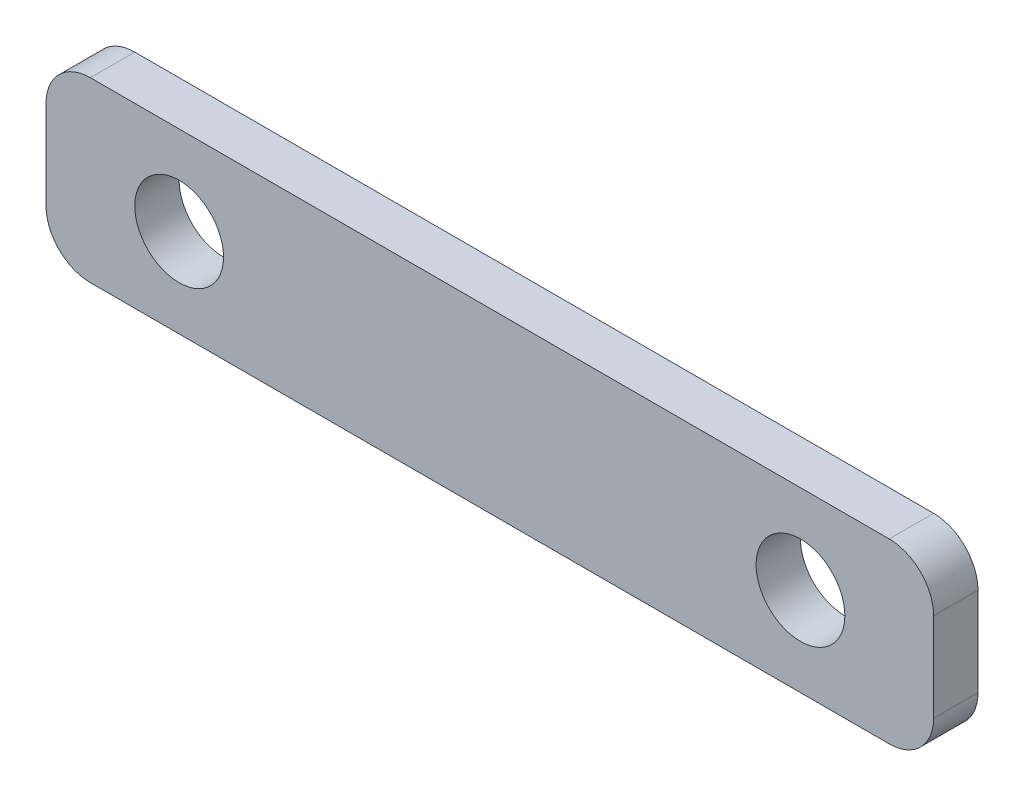
ISO-10303-21;
HEADER;
FILE_DESCRIPTION(('STEP AP214'),'2;1');
FILE_NAME('part.step','',(''),(''),'','','');
FILE_SCHEMA(('AUTOMOTIVE_DESIGN { 1 0 10303 214 1 1 1 1 }'));
ENDSEC;
DATA;
#1=APPLICATION_CONTEXT('core data for automotive mechanical design processes');
#2=APPLICATION_PROTOCOL_DEFINITION('international standard','automotive_design',2000,#1);
#3=PRODUCT_CONTEXT('',#1,'mechanical');
#4=PRODUCT('Part','Part','',(#3));
#5=PRODUCT_RELATED_PRODUCT_CATEGORY('part','',(#4));
#6=PRODUCT_DEFINITION_FORMATION('','',#4);
#7=PRODUCT_DEFINITION_CONTEXT('part definition',#1,'design');
#8=PRODUCT_DEFINITION('design','',#6,#7);
#9=PRODUCT_DEFINITION_SHAPE('','',#8);
#10=(LENGTH_UNIT() NAMED_UNIT(*) SI_UNIT(.MILLI.,.METRE.));
#11=(NAMED_UNIT(*) PLANE_ANGLE_UNIT() SI_UNIT($,.RADIAN.));
#12=(NAMED_UNIT(*) SI_UNIT($,.STERADIAN.) SOLID_ANGLE_UNIT());
#13=UNCERTAINTY_MEASURE_WITH_UNIT(LENGTH_MEASURE(1.E-05),#10,'distance_accuracy_value','');
#14=(GEOMETRIC_REPRESENTATION_CONTEXT(3) GLOBAL_UNCERTAINTY_ASSIGNED_CONTEXT((#13)) GLOBAL_UNIT_ASSIGNED_CONTEXT((#10,
#11,#12)) REPRESENTATION_CONTEXT('',''));
#15=CARTESIAN_POINT('',(0.,0.,0.));
#16=DIRECTION('',(0.,0.,1.));
#17=DIRECTION('',(1.,0.,0.));
#18=AXIS2_PLACEMENT_3D('',#15,#16,#17);
#19=CARTESIAN_POINT('',(-10.,120.683938375693,5.));
#20=DIRECTION('',(0.,0.,1.));
#21=DIRECTION('',(1.,0.,0.));
#22=AXIS2_PLACEMENT_3D('',#19,#20,#21);
#23=PLANE('',#22);
#24=CARTESIAN_POINT('',(-170.,130.683938375693,5.));
#25=DIRECTION('',(0.,0.,1.));
#26=DIRECTION('',(1.,0.,0.));
#27=AXIS2_PLACEMENT_3D('',#24,#25,#26);
#28=CIRCLE('',#27,10.);
#29=CARTESIAN_POINT('',(-160.,130.683938375693,5.));
#30=VERTEX_POINT('',#29);
#31=EDGE_CURVE('E133',#30,#30,#28,.T.);
#32=ORIENTED_EDGE('',*,*,#31,.F.);
#33=EDGE_LOOP('',(#32));
#34=FACE_BOUND('',#33,.T.);
#35=CARTESIAN_POINT('',(-10.,120.683938375693,5.));
#36=DIRECTION('',(0.,0.,1.));
#37=DIRECTION('',(1.,0.,0.));
#38=AXIS2_PLACEMENT_3D('',#35,#36,#37);
#39=CIRCLE('',#38,10.);
#40=CARTESIAN_POINT('',(-10.,110.683938375693,5.));
#41=VERTEX_POINT('',#40);
#42=CARTESIAN_POINT('',(0.,120.683938375693,5.));
#43=VERTEX_POINT('',#42);
#44=EDGE_CURVE('E144',#41,#43,#39,.T.);
#45=ORIENTED_EDGE('',*,*,#44,.T.);
#46=DIRECTION('',(0.,1.,0.));
#47=VECTOR('',#46,1.);
#48=CARTESIAN_POINT('',(0.,140.683938375693,5.));
#49=LINE('',#48,#47);
#50=CARTESIAN_POINT('',(0.,140.683938375693,5.));
#51=VERTEX_POINT('',#50);
#52=EDGE_CURVE('E92',#43,#51,#49,.T.);
#53=ORIENTED_EDGE('',*,*,#52,.T.);
#54=CARTESIAN_POINT('',(-10.,140.683938375693,5.));
#55=DIRECTION('',(0.,0.,1.));
#56=DIRECTION('',(-1.,0.,0.));
#57=AXIS2_PLACEMENT_3D('',#54,#55,#56);
#58=CIRCLE('',#57,9.99999999999999);
#59=CARTESIAN_POINT('',(-10.,150.683938375693,5.));
#60=VERTEX_POINT('',#59);
#61=EDGE_CURVE('E159',#51,#60,#58,.T.);
#62=ORIENTED_EDGE('',*,*,#61,.T.);
#63=DIRECTION('',(-1.,0.,0.));
#64=VECTOR('',#63,1.);
#65=CARTESIAN_POINT('',(-190.,150.683938375693,5.));
#66=LINE('',#65,#64);
#67=CARTESIAN_POINT('',(-190.,150.683938375693,5.));
#68=VERTEX_POINT('',#67);
#69=EDGE_CURVE('E172',#60,#68,#66,.T.);
#70=ORIENTED_EDGE('',*,*,#69,.T.);
#71=CARTESIAN_POINT('',(-190.,140.683938375693,5.));
#72=DIRECTION('',(0.,0.,1.));
#73=DIRECTION('',(1.,0.,0.));
#74=AXIS2_PLACEMENT_3D('',#71,#72,#73);
#75=CIRCLE('',#74,10.);
#76=CARTESIAN_POINT('',(-200.,140.683938375693,5.));
#77=VERTEX_POINT('',#76);
#78=EDGE_CURVE('E111',#68,#77,#75,.T.);
#79=ORIENTED_EDGE('',*,*,#78,.T.);
#80=DIRECTION('',(0.,-1.,0.));
#81=VECTOR('',#80,1.);
#82=CARTESIAN_POINT('',(-200.,140.683938375693,5.));
#83=LINE('',#82,#81);
#84=CARTESIAN_POINT('',(-200.,120.683938375693,5.));
#85=VERTEX_POINT('',#84);
#86=EDGE_CURVE('E105',#77,#85,#83,.T.);
#87=ORIENTED_EDGE('',*,*,#86,.T.);
#88=CARTESIAN_POINT('',(-190.,120.683938375693,5.));
#89=DIRECTION('',(0.,0.,1.));
#90=DIRECTION('',(1.,0.,0.));
#91=AXIS2_PLACEMENT_3D('',#88,#89,#90);
#92=CIRCLE('',#91,10.);
#93=CARTESIAN_POINT('',(-190.,110.683938375693,5.));
#94=VERTEX_POINT('',#93);
#95=EDGE_CURVE('E109',#85,#94,#92,.T.);
#96=ORIENTED_EDGE('',*,*,#95,.T.);
#97=DIRECTION('',(1.,0.,0.));
#98=VECTOR('',#97,1.);
#99=CARTESIAN_POINT('',(-190.,110.683938375693,5.));
#100=LINE('',#99,#98);
#101=EDGE_CURVE('E49',#94,#41,#100,.T.);
#102=ORIENTED_EDGE('',*,*,#101,.T.);
#103=EDGE_LOOP('',(#45,#53,#62,#70,#79,#87,#96,#102));
#104=FACE_BOUND('',#103,.T.);
#105=CARTESIAN_POINT('',(-30.,130.683938375693,5.));
#106=DIRECTION('',(0.,0.,1.));
#107=DIRECTION('',(1.,0.,0.));
#108=AXIS2_PLACEMENT_3D('',#105,#106,#107);
#109=CIRCLE('',#108,10.);
#110=CARTESIAN_POINT('',(-20.,130.683938375693,5.));
#111=VERTEX_POINT('',#110);
#112=EDGE_CURVE('E181',#111,#111,#109,.T.);
#113=ORIENTED_EDGE('',*,*,#112,.F.);
#114=EDGE_LOOP('',(#113));
#115=FACE_BOUND('',#114,.T.);
#116=ADVANCED_FACE('F32',(#34,#104,#115),#23,.T.);
#117=CARTESIAN_POINT('',(-10.,120.683938375693,-5.));
#118=DIRECTION('',(0.,0.,1.));
#119=DIRECTION('',(1.,0.,0.));
#120=AXIS2_PLACEMENT_3D('',#117,#118,#119);
#121=PLANE('',#120);
#122=CARTESIAN_POINT('',(-10.,120.683938375693,-5.));
#123=DIRECTION('',(0.,0.,1.));
#124=DIRECTION('',(1.,0.,0.));
#125=AXIS2_PLACEMENT_3D('',#122,#123,#124);
#126=CIRCLE('',#125,10.);
#127=CARTESIAN_POINT('',(-10.,110.683938375693,-5.));
#128=VERTEX_POINT('',#127);
#129=CARTESIAN_POINT('',(0.,120.683938375693,-5.));
#130=VERTEX_POINT('',#129);
#131=EDGE_CURVE('E129',#128,#130,#126,.T.);
#132=ORIENTED_EDGE('',*,*,#131,.F.);
#133=DIRECTION('',(1.,0.,0.));
#134=VECTOR('',#133,1.);
#135=CARTESIAN_POINT('',(-190.,110.683938375693,-5.));
#136=LINE('',#135,#134);
#137=CARTESIAN_POINT('',(-190.,110.683938375693,-5.));
#138=VERTEX_POINT('',#137);
#139=EDGE_CURVE('E84',#138,#128,#136,.T.);
#140=ORIENTED_EDGE('',*,*,#139,.F.);
#141=CARTESIAN_POINT('',(-190.,120.683938375693,-5.));
#142=DIRECTION('',(0.,0.,1.));
#143=DIRECTION('',(1.,0.,0.));
#144=AXIS2_PLACEMENT_3D('',#141,#142,#143);
#145=CIRCLE('',#144,10.);
#146=CARTESIAN_POINT('',(-200.,120.683938375693,-5.));
#147=VERTEX_POINT('',#146);
#148=EDGE_CURVE('E78',#147,#138,#145,.T.);
#149=ORIENTED_EDGE('',*,*,#148,.F.);
#150=DIRECTION('',(0.,-1.,0.));
#151=VECTOR('',#150,1.);
#152=CARTESIAN_POINT('',(-200.,140.683938375693,-5.));
#153=LINE('',#152,#151);
#154=CARTESIAN_POINT('',(-200.,140.683938375693,-5.));
#155=VERTEX_POINT('',#154);
#156=EDGE_CURVE('E119',#155,#147,#153,.T.);
#157=ORIENTED_EDGE('',*,*,#156,.F.);
#158=CARTESIAN_POINT('',(-190.,140.683938375693,-5.));
#159=DIRECTION('',(0.,0.,1.));
#160=DIRECTION('',(1.,0.,0.));
#161=AXIS2_PLACEMENT_3D('',#158,#159,#160);
#162=CIRCLE('',#161,10.);
#163=CARTESIAN_POINT('',(-190.,150.683938375693,-5.));
#164=VERTEX_POINT('',#163);
#165=EDGE_CURVE('E139',#164,#155,#162,.T.);
#166=ORIENTED_EDGE('',*,*,#165,.F.);
#167=DIRECTION('',(-1.,0.,0.));
#168=VECTOR('',#167,1.);
#169=CARTESIAN_POINT('',(-190.,150.683938375693,-5.));
#170=LINE('',#169,#168);
#171=CARTESIAN_POINT('',(-10.,150.683938375693,-5.));
#172=VERTEX_POINT('',#171);
#173=EDGE_CURVE('E137',#172,#164,#170,.T.);
#174=ORIENTED_EDGE('',*,*,#173,.F.);
#175=CARTESIAN_POINT('',(-10.,140.683938375693,-5.));
#176=DIRECTION('',(0.,0.,1.));
#177=DIRECTION('',(-1.,0.,0.));
#178=AXIS2_PLACEMENT_3D('',#175,#176,#177);
#179=CIRCLE('',#178,9.99999999999999);
#180=CARTESIAN_POINT('',(0.,140.683938375693,-5.));
#181=VERTEX_POINT('',#180);
#182=EDGE_CURVE('E135',#181,#172,#179,.T.);
#183=ORIENTED_EDGE('',*,*,#182,.F.);
#184=DIRECTION('',(0.,1.,0.));
#185=VECTOR('',#184,1.);
#186=CARTESIAN_POINT('',(0.,140.683938375693,-5.));
#187=LINE('',#186,#185);
#188=EDGE_CURVE('E132',#130,#181,#187,.T.);
#189=ORIENTED_EDGE('',*,*,#188,.F.);
#190=EDGE_LOOP('',(#132,#140,#149,#157,#166,#174,#183,#189));
#191=FACE_BOUND('',#190,.T.);
#192=CARTESIAN_POINT('',(-170.,130.683938375693,-5.));
#193=DIRECTION('',(0.,0.,1.));
#194=DIRECTION('',(1.,0.,0.));
#195=AXIS2_PLACEMENT_3D('',#192,#193,#194);
#196=CIRCLE('',#195,10.);
#197=CARTESIAN_POINT('',(-160.,130.683938375693,-5.));
#198=VERTEX_POINT('',#197);
#199=EDGE_CURVE('E178',#198,#198,#196,.T.);
#200=ORIENTED_EDGE('',*,*,#199,.T.);
#201=EDGE_LOOP('',(#200));
#202=FACE_BOUND('',#201,.T.);
#203=CARTESIAN_POINT('',(-30.,130.683938375693,-5.));
#204=DIRECTION('',(0.,0.,1.));
#205=DIRECTION('',(1.,0.,0.));
#206=AXIS2_PLACEMENT_3D('',#203,#204,#205);
#207=CIRCLE('',#206,10.);
#208=CARTESIAN_POINT('',(-20.,130.683938375693,-5.));
#209=VERTEX_POINT('',#208);
#210=EDGE_CURVE('E184',#209,#209,#207,.T.);
#211=ORIENTED_EDGE('',*,*,#210,.T.);
#212=EDGE_LOOP('',(#211));
#213=FACE_BOUND('',#212,.T.);
#214=ADVANCED_FACE('F163',(#191,#202,#213),#121,.F.);
#215=CARTESIAN_POINT('',(-10.,120.683938375693,5.));
#216=DIRECTION('',(0.,0.,-1.));
#217=DIRECTION('',(-1.,0.,0.));
#218=AXIS2_PLACEMENT_3D('',#215,#216,#217);
#219=CYLINDRICAL_SURFACE('',#218,10.);
#220=ORIENTED_EDGE('',*,*,#131,.T.);
#221=DIRECTION('',(0.,0.,-1.));
#222=VECTOR('',#221,1.);
#223=CARTESIAN_POINT('',(0.,120.683938375693,5.));
#224=LINE('',#223,#222);
#225=EDGE_CURVE('E11',#43,#130,#224,.T.);
#226=ORIENTED_EDGE('',*,*,#225,.F.);
#227=ORIENTED_EDGE('',*,*,#44,.F.);
#228=DIRECTION('',(0.,0.,-1.));
#229=VECTOR('',#228,1.);
#230=CARTESIAN_POINT('',(-10.,110.683938375693,5.));
#231=LINE('',#230,#229);
#232=EDGE_CURVE('E125',#41,#128,#231,.T.);
#233=ORIENTED_EDGE('',*,*,#232,.T.);
#234=EDGE_LOOP('',(#220,#226,#227,#233));
#235=FACE_BOUND('',#234,.T.);
#236=ADVANCED_FACE('F34',(#235),#219,.T.);
#237=CARTESIAN_POINT('',(0.,140.683938375693,5.));
#238=DIRECTION('',(-1.,0.,0.));
#239=DIRECTION('',(0.,0.,1.));
#240=AXIS2_PLACEMENT_3D('',#237,#238,#239);
#241=PLANE('',#240);
#242=ORIENTED_EDGE('',*,*,#188,.T.);
#243=DIRECTION('',(0.,0.,-1.));
#244=VECTOR('',#243,1.);
#245=CARTESIAN_POINT('',(0.,140.683938375693,5.));
#246=LINE('',#245,#244);
#247=EDGE_CURVE('E41',#51,#181,#246,.T.);
#248=ORIENTED_EDGE('',*,*,#247,.F.);
#249=ORIENTED_EDGE('',*,*,#52,.F.);
#250=ORIENTED_EDGE('',*,*,#225,.T.);
#251=EDGE_LOOP('',(#242,#248,#249,#250));
#252=FACE_BOUND('',#251,.T.);
#253=ADVANCED_FACE('F216',(#252),#241,.F.);
#254=CARTESIAN_POINT('',(-10.,140.683938375693,5.));
#255=DIRECTION('',(0.,0.,-1.));
#256=DIRECTION('',(-1.,0.,0.));
#257=AXIS2_PLACEMENT_3D('',#254,#255,#256);
#258=CYLINDRICAL_SURFACE('',#257,9.99999999999999);
#259=ORIENTED_EDGE('',*,*,#182,.T.);
#260=DIRECTION('',(0.,0.,-1.));
#261=VECTOR('',#260,1.);
#262=CARTESIAN_POINT('',(-10.,150.683938375693,5.));
#263=LINE('',#262,#261);
#264=EDGE_CURVE('E151',#60,#172,#263,.T.);
#265=ORIENTED_EDGE('',*,*,#264,.F.);
#266=ORIENTED_EDGE('',*,*,#61,.F.);
#267=ORIENTED_EDGE('',*,*,#247,.T.);
#268=EDGE_LOOP('',(#259,#265,#266,#267));
#269=FACE_BOUND('',#268,.T.);
#270=ADVANCED_FACE('F157',(#269),#258,.T.);
#271=CARTESIAN_POINT('',(-190.,150.683938375693,5.));
#272=DIRECTION('',(0.,-1.,0.));
#273=DIRECTION('',(1.,0.,0.));
#274=AXIS2_PLACEMENT_3D('',#271,#272,#273);
#275=PLANE('',#274);
#276=ORIENTED_EDGE('',*,*,#173,.T.);
#277=DIRECTION('',(0.,0.,-1.));
#278=VECTOR('',#277,1.);
#279=CARTESIAN_POINT('',(-190.,150.683938375693,5.));
#280=LINE('',#279,#278);
#281=EDGE_CURVE('E148',#68,#164,#280,.T.);
#282=ORIENTED_EDGE('',*,*,#281,.F.);
#283=ORIENTED_EDGE('',*,*,#69,.F.);
#284=ORIENTED_EDGE('',*,*,#264,.T.);
#285=EDGE_LOOP('',(#276,#282,#283,#284));
#286=FACE_BOUND('',#285,.T.);
#287=ADVANCED_FACE('F168',(#286),#275,.F.);
#288=CARTESIAN_POINT('',(-190.,140.683938375693,5.));
#289=DIRECTION('',(0.,0.,-1.));
#290=DIRECTION('',(-1.,0.,0.));
#291=AXIS2_PLACEMENT_3D('',#288,#289,#290);
#292=CYLINDRICAL_SURFACE('',#291,10.);
#293=ORIENTED_EDGE('',*,*,#165,.T.);
#294=DIRECTION('',(0.,0.,-1.));
#295=VECTOR('',#294,1.);
#296=CARTESIAN_POINT('',(-200.,140.683938375693,5.));
#297=LINE('',#296,#295);
#298=EDGE_CURVE('E120',#77,#155,#297,.T.);
#299=ORIENTED_EDGE('',*,*,#298,.F.);
#300=ORIENTED_EDGE('',*,*,#78,.F.);
#301=ORIENTED_EDGE('',*,*,#281,.T.);
#302=EDGE_LOOP('',(#293,#299,#300,#301));
#303=FACE_BOUND('',#302,.T.);
#304=ADVANCED_FACE('F171',(#303),#292,.T.);
#305=CARTESIAN_POINT('',(-200.,140.683938375693,5.));
#306=DIRECTION('',(1.,0.,0.));
#307=DIRECTION('',(0.,0.,-1.));
#308=AXIS2_PLACEMENT_3D('',#305,#306,#307);
#309=PLANE('',#308);
#310=ORIENTED_EDGE('',*,*,#156,.T.);
#311=DIRECTION('',(0.,0.,-1.));
#312=VECTOR('',#311,1.);
#313=CARTESIAN_POINT('',(-200.,120.683938375693,5.));
#314=LINE('',#313,#312);
#315=EDGE_CURVE('E116',#85,#147,#314,.T.);
#316=ORIENTED_EDGE('',*,*,#315,.F.);
#317=ORIENTED_EDGE('',*,*,#86,.F.);
#318=ORIENTED_EDGE('',*,*,#298,.T.);
#319=EDGE_LOOP('',(#310,#316,#317,#318));
#320=FACE_BOUND('',#319,.T.);
#321=ADVANCED_FACE('F117',(#320),#309,.F.);
#322=CARTESIAN_POINT('',(-190.,120.683938375693,5.));
#323=DIRECTION('',(0.,0.,-1.));
#324=DIRECTION('',(-1.,0.,0.));
#325=AXIS2_PLACEMENT_3D('',#322,#323,#324);
#326=CYLINDRICAL_SURFACE('',#325,10.);
#327=ORIENTED_EDGE('',*,*,#148,.T.);
#328=DIRECTION('',(0.,0.,-1.));
#329=VECTOR('',#328,1.);
#330=CARTESIAN_POINT('',(-190.,110.683938375693,5.));
#331=LINE('',#330,#329);
#332=EDGE_CURVE('E121',#94,#138,#331,.T.);
#333=ORIENTED_EDGE('',*,*,#332,.F.);
#334=ORIENTED_EDGE('',*,*,#95,.F.);
#335=ORIENTED_EDGE('',*,*,#315,.T.);
#336=EDGE_LOOP('',(#327,#333,#334,#335));
#337=FACE_BOUND('',#336,.T.);
#338=ADVANCED_FACE('F123',(#337),#326,.T.);
#339=CARTESIAN_POINT('',(-190.,110.683938375693,5.));
#340=DIRECTION('',(0.,1.,0.));
#341=DIRECTION('',(0.,0.,1.));
#342=AXIS2_PLACEMENT_3D('',#339,#340,#341);
#343=PLANE('',#342);
#344=ORIENTED_EDGE('',*,*,#139,.T.);
#345=ORIENTED_EDGE('',*,*,#232,.F.);
#346=ORIENTED_EDGE('',*,*,#101,.F.);
#347=ORIENTED_EDGE('',*,*,#332,.T.);
#348=EDGE_LOOP('',(#344,#345,#346,#347));
#349=FACE_BOUND('',#348,.T.);
#350=ADVANCED_FACE('F204',(#349),#343,.F.);
#351=CARTESIAN_POINT('',(-170.,130.683938375693,5.));
#352=DIRECTION('',(0.,0.,-1.));
#353=DIRECTION('',(-1.,0.,0.));
#354=AXIS2_PLACEMENT_3D('',#351,#352,#353);
#355=CYLINDRICAL_SURFACE('',#354,10.);
#356=ORIENTED_EDGE('',*,*,#31,.T.);
#357=EDGE_LOOP('',(#356));
#358=FACE_BOUND('',#357,.T.);
#359=ORIENTED_EDGE('',*,*,#199,.F.);
#360=EDGE_LOOP('',(#359));
#361=FACE_BOUND('',#360,.T.);
#362=ADVANCED_FACE('F201',(#358,#361),#355,.F.);
#363=CARTESIAN_POINT('',(-30.,130.683938375693,5.));
#364=DIRECTION('',(0.,0.,-1.));
#365=DIRECTION('',(-1.,0.,0.));
#366=AXIS2_PLACEMENT_3D('',#363,#364,#365);
#367=CYLINDRICAL_SURFACE('',#366,10.);
#368=ORIENTED_EDGE('',*,*,#112,.T.);
#369=EDGE_LOOP('',(#368));
#370=FACE_BOUND('',#369,.T.);
#371=ORIENTED_EDGE('',*,*,#210,.F.);
#372=EDGE_LOOP('',(#371));
#373=FACE_BOUND('',#372,.T.);
#374=ADVANCED_FACE('F190',(#370,#373),#367,.F.);
#375=CLOSED_SHELL('',(#116,#214,#236,#253,#270,#287,#304,#321,#338,#350,#362,#374));
#376=MANIFOLD_SOLID_BREP('B2',#375);
#377=ADVANCED_BREP_SHAPE_REPRESENTATION('',(#18,#376),#14);
#378=SHAPE_DEFINITION_REPRESENTATION(#9,#377);
ENDSEC;
END-ISO-10303-21;
